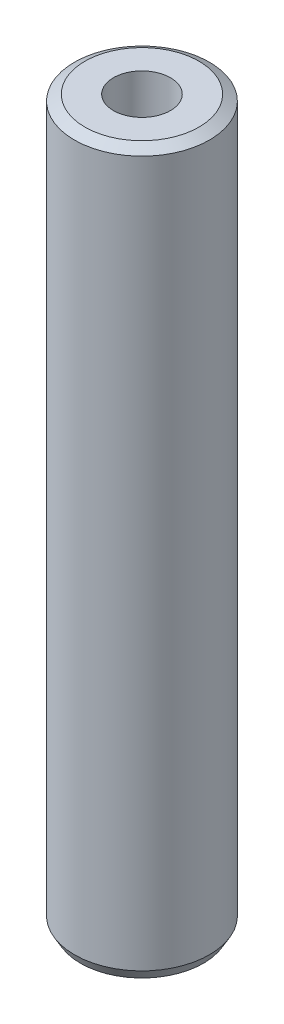
ISO-10303-21;
HEADER;
FILE_DESCRIPTION(('STEP AP214'),'2;1');
FILE_NAME('part.step','',(''),(''),'','','');
FILE_SCHEMA(('AUTOMOTIVE_DESIGN { 1 0 10303 214 1 1 1 1 }'));
ENDSEC;
DATA;
#1=APPLICATION_CONTEXT('core data for automotive mechanical design processes');
#2=APPLICATION_PROTOCOL_DEFINITION('international standard','automotive_design',2000,#1);
#3=PRODUCT_CONTEXT('',#1,'mechanical');
#4=PRODUCT('Part','Part','',(#3));
#5=PRODUCT_RELATED_PRODUCT_CATEGORY('part','',(#4));
#6=PRODUCT_DEFINITION_FORMATION('','',#4);
#7=PRODUCT_DEFINITION_CONTEXT('part definition',#1,'design');
#8=PRODUCT_DEFINITION('design','',#6,#7);
#9=PRODUCT_DEFINITION_SHAPE('','',#8);
#10=(LENGTH_UNIT() NAMED_UNIT(*) SI_UNIT(.MILLI.,.METRE.));
#11=(NAMED_UNIT(*) PLANE_ANGLE_UNIT() SI_UNIT($,.RADIAN.));
#12=(NAMED_UNIT(*) SI_UNIT($,.STERADIAN.) SOLID_ANGLE_UNIT());
#13=UNCERTAINTY_MEASURE_WITH_UNIT(LENGTH_MEASURE(1.E-05),#10,'distance_accuracy_value','');
#14=(GEOMETRIC_REPRESENTATION_CONTEXT(3) GLOBAL_UNCERTAINTY_ASSIGNED_CONTEXT((#13)) GLOBAL_UNIT_ASSIGNED_CONTEXT((#10,
#11,#12)) REPRESENTATION_CONTEXT('',''));
#15=CARTESIAN_POINT('',(0.,0.,0.));
#16=DIRECTION('',(0.,0.,1.));
#17=DIRECTION('',(1.,0.,0.));
#18=AXIS2_PLACEMENT_3D('',#15,#16,#17);
#19=CARTESIAN_POINT('',(0.,294.16890187579,0.));
#20=DIRECTION('',(0.,-1.,0.));
#21=DIRECTION('',(0.,0.,-1.));
#22=AXIS2_PLACEMENT_3D('',#19,#20,#21);
#23=CYLINDRICAL_SURFACE('',#22,27.5);
#24=CARTESIAN_POINT('',(0.,291.716907333959,0.));
#25=DIRECTION('',(0.,1.,0.));
#26=DIRECTION('',(0.,0.,1.));
#27=AXIS2_PLACEMENT_3D('',#24,#25,#26);
#28=CIRCLE('',#27,27.5);
#29=CARTESIAN_POINT('',(0.,291.716907333959,27.5));
#30=VERTEX_POINT('',#29);
#31=EDGE_CURVE('E50',#30,#30,#28,.F.);
#32=ORIENTED_EDGE('',*,*,#31,.T.);
#33=EDGE_LOOP('',(#32));
#34=FACE_BOUND('',#33,.T.);
#35=CARTESIAN_POINT('',(0.,4.24697912633398,0.));
#36=DIRECTION('',(0.,1.,0.));
#37=DIRECTION('',(0.,0.,1.));
#38=AXIS2_PLACEMENT_3D('',#35,#36,#37);
#39=CIRCLE('',#38,27.5);
#40=CARTESIAN_POINT('',(0.,4.24697912633398,27.5));
#41=VERTEX_POINT('',#40);
#42=EDGE_CURVE('E51',#41,#41,#39,.T.);
#43=ORIENTED_EDGE('',*,*,#42,.T.);
#44=EDGE_LOOP('',(#43));
#45=FACE_BOUND('',#44,.T.);
#46=ADVANCED_FACE('F39',(#34,#45),#23,.T.);
#47=CARTESIAN_POINT('',(0.,294.16890187579,0.));
#48=DIRECTION('',(0.,1.,0.));
#49=DIRECTION('',(0.,0.,1.));
#50=AXIS2_PLACEMENT_3D('',#47,#48,#49);
#51=PLANE('',#50);
#52=CARTESIAN_POINT('',(0.,294.16890187579,0.));
#53=DIRECTION('',(0.,1.,0.));
#54=DIRECTION('',(0.,0.,1.));
#55=AXIS2_PLACEMENT_3D('',#52,#53,#54);
#56=CIRCLE('',#55,23.253020873666);
#57=CARTESIAN_POINT('',(0.,294.16890187579,23.253020873666));
#58=VERTEX_POINT('',#57);
#59=EDGE_CURVE('E54',#58,#58,#56,.T.);
#60=ORIENTED_EDGE('',*,*,#59,.T.);
#61=EDGE_LOOP('',(#60));
#62=FACE_BOUND('',#61,.T.);
#63=CARTESIAN_POINT('',(0.,294.16890187579,0.));
#64=DIRECTION('',(0.,1.,0.));
#65=DIRECTION('',(0.,0.,1.));
#66=AXIS2_PLACEMENT_3D('',#63,#64,#65);
#67=CIRCLE('',#66,11.6192219724934);
#68=CARTESIAN_POINT('',(0.,294.16890187579,11.6192219724934));
#69=VERTEX_POINT('',#68);
#70=EDGE_CURVE('E58',#69,#69,#67,.T.);
#71=ORIENTED_EDGE('',*,*,#70,.F.);
#72=EDGE_LOOP('',(#71));
#73=FACE_BOUND('',#72,.T.);
#74=ADVANCED_FACE('F69',(#62,#73),#51,.T.);
#75=CARTESIAN_POINT('',(0.,0.,0.));
#76=DIRECTION('',(0.,1.,0.));
#77=DIRECTION('',(0.,0.,1.));
#78=AXIS2_PLACEMENT_3D('',#75,#76,#77);
#79=PLANE('',#78);
#80=CARTESIAN_POINT('',(0.,0.,0.));
#81=DIRECTION('',(0.,1.,0.));
#82=DIRECTION('',(0.,0.,1.));
#83=AXIS2_PLACEMENT_3D('',#80,#81,#82);
#84=CIRCLE('',#83,25.0480054581683);
#85=CARTESIAN_POINT('',(0.,0.,25.0480054581683));
#86=VERTEX_POINT('',#85);
#87=EDGE_CURVE('E10',#86,#86,#84,.F.);
#88=ORIENTED_EDGE('',*,*,#87,.T.);
#89=EDGE_LOOP('',(#88));
#90=FACE_BOUND('',#89,.T.);
#91=CARTESIAN_POINT('',(0.,0.,0.));
#92=DIRECTION('',(0.,1.,0.));
#93=DIRECTION('',(0.,0.,1.));
#94=AXIS2_PLACEMENT_3D('',#91,#92,#93);
#95=CIRCLE('',#94,11.6192219724934);
#96=CARTESIAN_POINT('',(0.,0.,11.6192219724934));
#97=VERTEX_POINT('',#96);
#98=EDGE_CURVE('E63',#97,#97,#95,.T.);
#99=ORIENTED_EDGE('',*,*,#98,.T.);
#100=EDGE_LOOP('',(#99));
#101=FACE_BOUND('',#100,.T.);
#102=ADVANCED_FACE('F75',(#90,#101),#79,.F.);
#103=CARTESIAN_POINT('',(0.,294.16890187579,0.));
#104=DIRECTION('',(0.,-1.,0.));
#105=DIRECTION('',(0.,0.,-1.));
#106=AXIS2_PLACEMENT_3D('',#103,#104,#105);
#107=CYLINDRICAL_SURFACE('',#106,11.6192219724934);
#108=ORIENTED_EDGE('',*,*,#70,.T.);
#109=EDGE_LOOP('',(#108));
#110=FACE_BOUND('',#109,.T.);
#111=ORIENTED_EDGE('',*,*,#98,.F.);
#112=EDGE_LOOP('',(#111));
#113=FACE_BOUND('',#112,.T.);
#114=ADVANCED_FACE('F70',(#110,#113),#107,.F.);
#115=CARTESIAN_POINT('',(0.,294.16890187579,0.));
#116=DIRECTION('',(0.,-1.,0.));
#117=DIRECTION('',(0.,0.,-1.));
#118=AXIS2_PLACEMENT_3D('',#115,#116,#117);
#119=CONICAL_SURFACE('',#118,23.253020873666,1.0471975511966);
#120=ORIENTED_EDGE('',*,*,#31,.F.);
#121=EDGE_LOOP('',(#120));
#122=FACE_BOUND('',#121,.T.);
#123=ORIENTED_EDGE('',*,*,#59,.F.);
#124=EDGE_LOOP('',(#123));
#125=FACE_BOUND('',#124,.T.);
#126=ADVANCED_FACE('F81',(#122,#125),#119,.T.);
#127=CARTESIAN_POINT('',(0.,4.24697912633398,0.));
#128=DIRECTION('',(0.,1.,0.));
#129=DIRECTION('',(0.,0.,1.));
#130=AXIS2_PLACEMENT_3D('',#127,#128,#129);
#131=CONICAL_SURFACE('',#130,27.5,0.5235987755983);
#132=ORIENTED_EDGE('',*,*,#87,.F.);
#133=EDGE_LOOP('',(#132));
#134=FACE_BOUND('',#133,.T.);
#135=ORIENTED_EDGE('',*,*,#42,.F.);
#136=EDGE_LOOP('',(#135));
#137=FACE_BOUND('',#136,.T.);
#138=ADVANCED_FACE('F45',(#134,#137),#131,.T.);
#139=CLOSED_SHELL('',(#46,#74,#102,#114,#126,#138));
#140=MANIFOLD_SOLID_BREP('B2',#139);
#141=ADVANCED_BREP_SHAPE_REPRESENTATION('',(#18,#140),#14);
#142=SHAPE_DEFINITION_REPRESENTATION(#9,#141);
ENDSEC;
END-ISO-10303-21;
